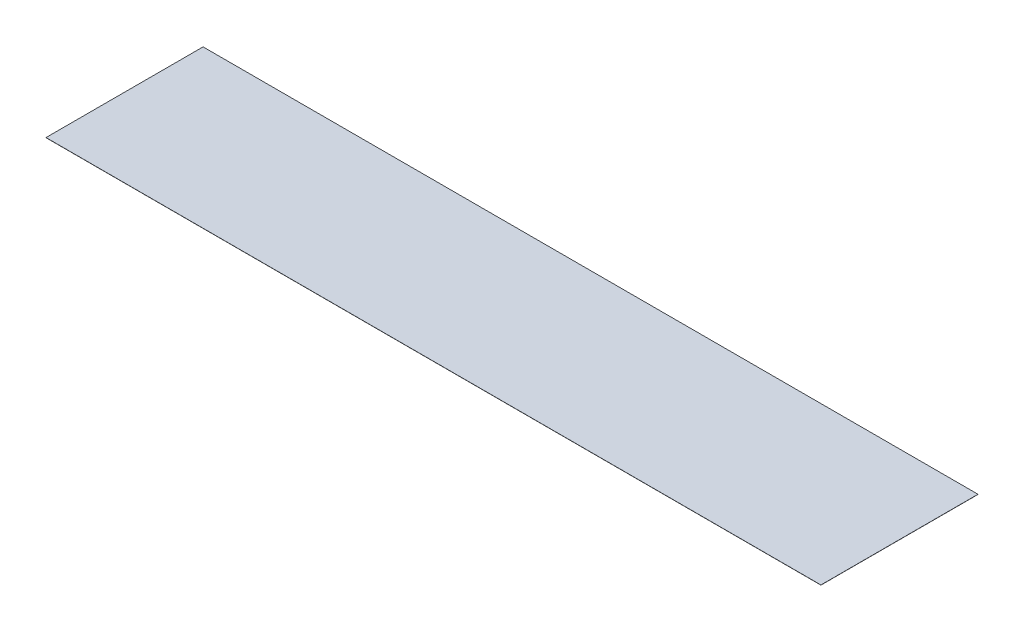
ISO-10303-21;
HEADER;
FILE_DESCRIPTION(('STEP AP214'),'2;1');
FILE_NAME('part.step','',(''),(''),'','','');
FILE_SCHEMA(('AUTOMOTIVE_DESIGN { 1 0 10303 214 1 1 1 1 }'));
ENDSEC;
DATA;
#1=APPLICATION_CONTEXT('core data for automotive mechanical design processes');
#2=APPLICATION_PROTOCOL_DEFINITION('international standard','automotive_design',2000,#1);
#3=PRODUCT_CONTEXT('',#1,'mechanical');
#4=PRODUCT('Part','Part','',(#3));
#5=PRODUCT_RELATED_PRODUCT_CATEGORY('part','',(#4));
#6=PRODUCT_DEFINITION_FORMATION('','',#4);
#7=PRODUCT_DEFINITION_CONTEXT('part definition',#1,'design');
#8=PRODUCT_DEFINITION('design','',#6,#7);
#9=PRODUCT_DEFINITION_SHAPE('','',#8);
#10=(LENGTH_UNIT() NAMED_UNIT(*) SI_UNIT(.MILLI.,.METRE.));
#11=(NAMED_UNIT(*) PLANE_ANGLE_UNIT() SI_UNIT($,.RADIAN.));
#12=(NAMED_UNIT(*) SI_UNIT($,.STERADIAN.) SOLID_ANGLE_UNIT());
#13=UNCERTAINTY_MEASURE_WITH_UNIT(LENGTH_MEASURE(1.E-05),#10,'distance_accuracy_value','');
#14=(GEOMETRIC_REPRESENTATION_CONTEXT(3) GLOBAL_UNCERTAINTY_ASSIGNED_CONTEXT((#13)) GLOBAL_UNIT_ASSIGNED_CONTEXT((#10,
#11,#12)) REPRESENTATION_CONTEXT('',''));
#15=CARTESIAN_POINT('',(0.,0.,0.));
#16=DIRECTION('',(0.,0.,1.));
#17=DIRECTION('',(1.,0.,0.));
#18=AXIS2_PLACEMENT_3D('',#15,#16,#17);
#19=CARTESIAN_POINT('',(0.,4.7752,0.));
#20=DIRECTION('',(1.,0.,0.));
#21=DIRECTION('',(0.,0.,-1.));
#22=AXIS2_PLACEMENT_3D('',#19,#20,#21);
#23=PLANE('',#22);
#24=DIRECTION('',(0.,0.,1.));
#25=VECTOR('',#24,1.);
#26=CARTESIAN_POINT('',(0.,0.,0.));
#27=LINE('',#26,#25);
#28=CARTESIAN_POINT('',(0.,-2.03000116716368E-12,-4572.));
#29=VERTEX_POINT('',#28);
#30=CARTESIAN_POINT('',(0.,0.,0.));
#31=VERTEX_POINT('',#30);
#32=EDGE_CURVE('E91',#29,#31,#27,.T.);
#33=ORIENTED_EDGE('',*,*,#32,.T.);
#34=DIRECTION('',(0.,-1.,0.));
#35=VECTOR('',#34,1.);
#36=CARTESIAN_POINT('',(0.,4.7752,0.));
#37=LINE('',#36,#35);
#38=CARTESIAN_POINT('',(0.,4.7752,0.));
#39=VERTEX_POINT('',#38);
#40=EDGE_CURVE('E11',#39,#31,#37,.T.);
#41=ORIENTED_EDGE('',*,*,#40,.F.);
#42=DIRECTION('',(0.,0.,1.));
#43=VECTOR('',#42,1.);
#44=CARTESIAN_POINT('',(0.,4.7752,0.));
#45=LINE('',#44,#43);
#46=CARTESIAN_POINT('',(0.,4.77519999999797,-4572.));
#47=VERTEX_POINT('',#46);
#48=EDGE_CURVE('E79',#47,#39,#45,.T.);
#49=ORIENTED_EDGE('',*,*,#48,.F.);
#50=DIRECTION('',(0.,-1.,0.));
#51=VECTOR('',#50,1.);
#52=CARTESIAN_POINT('',(0.,4.77519999999797,-4572.));
#53=LINE('',#52,#51);
#54=EDGE_CURVE('E87',#47,#29,#53,.T.);
#55=ORIENTED_EDGE('',*,*,#54,.T.);
#56=EDGE_LOOP('',(#33,#41,#49,#55));
#57=FACE_BOUND('',#56,.T.);
#58=ADVANCED_FACE('F28',(#57),#23,.F.);
#59=CARTESIAN_POINT('',(0.,4.7752,0.));
#60=DIRECTION('',(0.,0.,-1.));
#61=DIRECTION('',(-1.,0.,0.));
#62=AXIS2_PLACEMENT_3D('',#59,#60,#61);
#63=PLANE('',#62);
#64=DIRECTION('',(1.,0.,0.));
#65=VECTOR('',#64,1.);
#66=CARTESIAN_POINT('',(0.,0.,0.));
#67=LINE('',#66,#65);
#68=CARTESIAN_POINT('',(22555.2,0.,0.));
#69=VERTEX_POINT('',#68);
#70=EDGE_CURVE('E83',#31,#69,#67,.T.);
#71=ORIENTED_EDGE('',*,*,#70,.T.);
#72=DIRECTION('',(0.,-1.,0.));
#73=VECTOR('',#72,1.);
#74=CARTESIAN_POINT('',(22555.2,4.7752,0.));
#75=LINE('',#74,#73);
#76=CARTESIAN_POINT('',(22555.2,4.7752,0.));
#77=VERTEX_POINT('',#76);
#78=EDGE_CURVE('E36',#77,#69,#75,.T.);
#79=ORIENTED_EDGE('',*,*,#78,.F.);
#80=DIRECTION('',(1.,0.,0.));
#81=VECTOR('',#80,1.);
#82=CARTESIAN_POINT('',(0.,4.7752,0.));
#83=LINE('',#82,#81);
#84=EDGE_CURVE('E74',#39,#77,#83,.T.);
#85=ORIENTED_EDGE('',*,*,#84,.F.);
#86=ORIENTED_EDGE('',*,*,#40,.T.);
#87=EDGE_LOOP('',(#71,#79,#85,#86));
#88=FACE_BOUND('',#87,.T.);
#89=ADVANCED_FACE('F82',(#88),#63,.F.);
#90=CARTESIAN_POINT('',(22555.2,4.7752,0.));
#91=DIRECTION('',(-1.,0.,0.));
#92=DIRECTION('',(0.,0.,1.));
#93=AXIS2_PLACEMENT_3D('',#90,#91,#92);
#94=PLANE('',#93);
#95=DIRECTION('',(0.,0.,-1.));
#96=VECTOR('',#95,1.);
#97=CARTESIAN_POINT('',(22555.2,0.,0.));
#98=LINE('',#97,#96);
#99=CARTESIAN_POINT('',(22555.2,-2.03000116716368E-12,-4572.));
#100=VERTEX_POINT('',#99);
#101=EDGE_CURVE('E61',#69,#100,#98,.T.);
#102=ORIENTED_EDGE('',*,*,#101,.T.);
#103=DIRECTION('',(0.,-1.,0.));
#104=VECTOR('',#103,1.);
#105=CARTESIAN_POINT('',(22555.2,4.77519999999797,-4572.));
#106=LINE('',#105,#104);
#107=CARTESIAN_POINT('',(22555.2,4.77519999999797,-4572.));
#108=VERTEX_POINT('',#107);
#109=EDGE_CURVE('E84',#108,#100,#106,.T.);
#110=ORIENTED_EDGE('',*,*,#109,.F.);
#111=DIRECTION('',(0.,0.,-1.));
#112=VECTOR('',#111,1.);
#113=CARTESIAN_POINT('',(22555.2,4.7752,0.));
#114=LINE('',#113,#112);
#115=EDGE_CURVE('E77',#77,#108,#114,.T.);
#116=ORIENTED_EDGE('',*,*,#115,.F.);
#117=ORIENTED_EDGE('',*,*,#78,.T.);
#118=EDGE_LOOP('',(#102,#110,#116,#117));
#119=FACE_BOUND('',#118,.T.);
#120=ADVANCED_FACE('F85',(#119),#94,.F.);
#121=CARTESIAN_POINT('',(0.,4.77519999999797,-4572.));
#122=DIRECTION('',(0.,0.,1.));
#123=DIRECTION('',(1.,0.,0.));
#124=AXIS2_PLACEMENT_3D('',#121,#122,#123);
#125=PLANE('',#124);
#126=DIRECTION('',(-1.,0.,0.));
#127=VECTOR('',#126,1.);
#128=CARTESIAN_POINT('',(0.,-2.03000116716368E-12,-4572.));
#129=LINE('',#128,#127);
#130=EDGE_CURVE('E67',#100,#29,#129,.T.);
#131=ORIENTED_EDGE('',*,*,#130,.T.);
#132=ORIENTED_EDGE('',*,*,#54,.F.);
#133=DIRECTION('',(-1.,0.,0.));
#134=VECTOR('',#133,1.);
#135=CARTESIAN_POINT('',(0.,4.77519999999797,-4572.));
#136=LINE('',#135,#134);
#137=EDGE_CURVE('E44',#108,#47,#136,.T.);
#138=ORIENTED_EDGE('',*,*,#137,.F.);
#139=ORIENTED_EDGE('',*,*,#109,.T.);
#140=EDGE_LOOP('',(#131,#132,#138,#139));
#141=FACE_BOUND('',#140,.T.);
#142=ADVANCED_FACE('F98',(#141),#125,.F.);
#143=CARTESIAN_POINT('',(0.,4.7752,0.));
#144=DIRECTION('',(0.,-1.,0.));
#145=DIRECTION('',(0.,0.,-1.));
#146=AXIS2_PLACEMENT_3D('',#143,#144,#145);
#147=PLANE('',#146);
#148=ORIENTED_EDGE('',*,*,#48,.T.);
#149=ORIENTED_EDGE('',*,*,#84,.T.);
#150=ORIENTED_EDGE('',*,*,#115,.T.);
#151=ORIENTED_EDGE('',*,*,#137,.T.);
#152=EDGE_LOOP('',(#148,#149,#150,#151));
#153=FACE_BOUND('',#152,.T.);
#154=ADVANCED_FACE('F75',(#153),#147,.F.);
#155=CARTESIAN_POINT('',(0.,0.,0.));
#156=DIRECTION('',(0.,-1.,0.));
#157=DIRECTION('',(0.,0.,-1.));
#158=AXIS2_PLACEMENT_3D('',#155,#156,#157);
#159=PLANE('',#158);
#160=ORIENTED_EDGE('',*,*,#32,.F.);
#161=ORIENTED_EDGE('',*,*,#130,.F.);
#162=ORIENTED_EDGE('',*,*,#101,.F.);
#163=ORIENTED_EDGE('',*,*,#70,.F.);
#164=EDGE_LOOP('',(#160,#161,#162,#163));
#165=FACE_BOUND('',#164,.T.);
#166=ADVANCED_FACE('F101',(#165),#159,.T.);
#167=CLOSED_SHELL('',(#58,#89,#120,#142,#154,#166));
#168=MANIFOLD_SOLID_BREP('B2',#167);
#169=ADVANCED_BREP_SHAPE_REPRESENTATION('',(#18,#168),#14);
#170=SHAPE_DEFINITION_REPRESENTATION(#9,#169);
ENDSEC;
END-ISO-10303-21;
